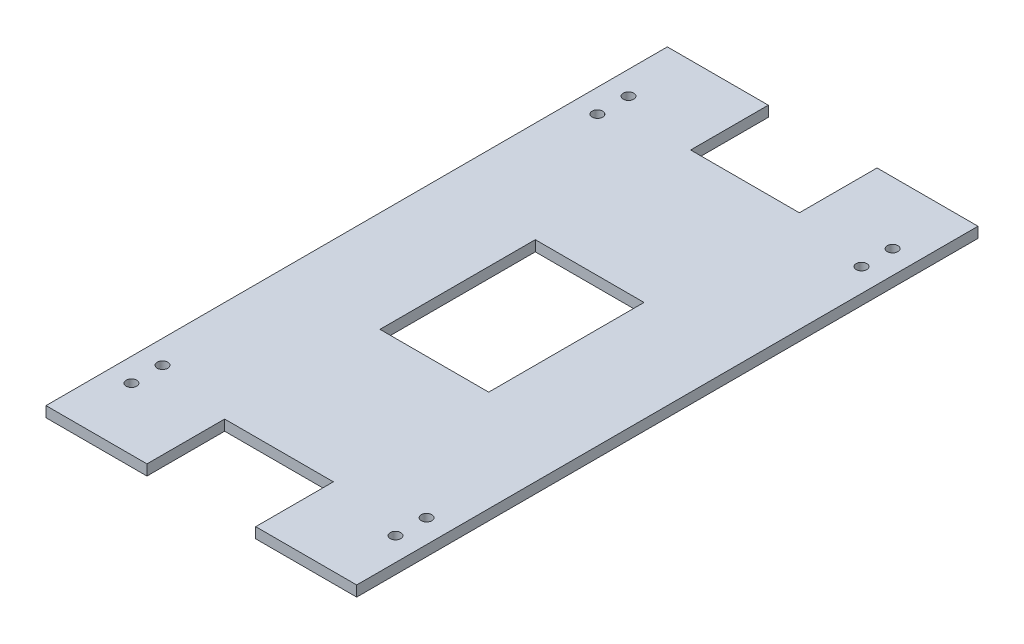
ISO-10303-21;
HEADER;
FILE_DESCRIPTION(('STEP AP214'),'2;1');
FILE_NAME('part.step','',(''),(''),'','','');
FILE_SCHEMA(('AUTOMOTIVE_DESIGN { 1 0 10303 214 1 1 1 1 }'));
ENDSEC;
DATA;
#1=APPLICATION_CONTEXT('core data for automotive mechanical design processes');
#2=APPLICATION_PROTOCOL_DEFINITION('international standard','automotive_design',2000,#1);
#3=PRODUCT_CONTEXT('',#1,'mechanical');
#4=PRODUCT('Part','Part','',(#3));
#5=PRODUCT_RELATED_PRODUCT_CATEGORY('part','',(#4));
#6=PRODUCT_DEFINITION_FORMATION('','',#4);
#7=PRODUCT_DEFINITION_CONTEXT('part definition',#1,'design');
#8=PRODUCT_DEFINITION('design','',#6,#7);
#9=PRODUCT_DEFINITION_SHAPE('','',#8);
#10=(LENGTH_UNIT() NAMED_UNIT(*) SI_UNIT(.MILLI.,.METRE.));
#11=(NAMED_UNIT(*) PLANE_ANGLE_UNIT() SI_UNIT($,.RADIAN.));
#12=(NAMED_UNIT(*) SI_UNIT($,.STERADIAN.) SOLID_ANGLE_UNIT());
#13=UNCERTAINTY_MEASURE_WITH_UNIT(LENGTH_MEASURE(1.E-05),#10,'distance_accuracy_value','');
#14=(GEOMETRIC_REPRESENTATION_CONTEXT(3) GLOBAL_UNCERTAINTY_ASSIGNED_CONTEXT((#13)) GLOBAL_UNIT_ASSIGNED_CONTEXT((#10,
#11,#12)) REPRESENTATION_CONTEXT('',''));
#15=CARTESIAN_POINT('',(0.,0.,0.));
#16=DIRECTION('',(0.,0.,1.));
#17=DIRECTION('',(1.,0.,0.));
#18=AXIS2_PLACEMENT_3D('',#15,#16,#17);
#19=CARTESIAN_POINT('',(-50.,3.4,-100.));
#20=DIRECTION('',(0.,0.,1.));
#21=DIRECTION('',(1.,0.,0.));
#22=AXIS2_PLACEMENT_3D('',#19,#20,#21);
#23=PLANE('',#22);
#24=DIRECTION('',(-1.,0.,0.));
#25=VECTOR('',#24,1.);
#26=CARTESIAN_POINT('',(-50.,3.4,-100.));
#27=LINE('',#26,#25);
#28=CARTESIAN_POINT('',(-17.5,3.4,-100.));
#29=VERTEX_POINT('',#28);
#30=CARTESIAN_POINT('',(-50.,3.4,-100.));
#31=VERTEX_POINT('',#30);
#32=EDGE_CURVE('E224',#29,#31,#27,.T.);
#33=ORIENTED_EDGE('',*,*,#32,.F.);
#34=DIRECTION('',(0.,1.,0.));
#35=VECTOR('',#34,1.);
#36=CARTESIAN_POINT('',(-17.5,-61.0327780786685,-100.));
#37=LINE('',#36,#35);
#38=CARTESIAN_POINT('',(-17.5,0.,-100.));
#39=VERTEX_POINT('',#38);
#40=EDGE_CURVE('E263',#39,#29,#37,.T.);
#41=ORIENTED_EDGE('',*,*,#40,.F.);
#42=DIRECTION('',(-1.,0.,0.));
#43=VECTOR('',#42,1.);
#44=CARTESIAN_POINT('',(-50.,0.,-100.));
#45=LINE('',#44,#43);
#46=CARTESIAN_POINT('',(-50.,0.,-100.));
#47=VERTEX_POINT('',#46);
#48=EDGE_CURVE('E186',#39,#47,#45,.T.);
#49=ORIENTED_EDGE('',*,*,#48,.T.);
#50=DIRECTION('',(0.,-1.,0.));
#51=VECTOR('',#50,1.);
#52=CARTESIAN_POINT('',(-50.,3.4,-100.));
#53=LINE('',#52,#51);
#54=EDGE_CURVE('E41',#31,#47,#53,.T.);
#55=ORIENTED_EDGE('',*,*,#54,.F.);
#56=EDGE_LOOP('',(#33,#41,#49,#55));
#57=FACE_BOUND('',#56,.T.);
#58=ADVANCED_FACE('F33',(#57),#23,.F.);
#59=CARTESIAN_POINT('',(-50.,3.4,100.));
#60=DIRECTION('',(0.,0.,-1.));
#61=DIRECTION('',(-1.,0.,0.));
#62=AXIS2_PLACEMENT_3D('',#59,#60,#61);
#63=PLANE('',#62);
#64=DIRECTION('',(1.,0.,0.));
#65=VECTOR('',#64,1.);
#66=CARTESIAN_POINT('',(-50.,0.,100.));
#67=LINE('',#66,#65);
#68=CARTESIAN_POINT('',(-50.,0.,100.));
#69=VERTEX_POINT('',#68);
#70=CARTESIAN_POINT('',(-17.5,0.,100.));
#71=VERTEX_POINT('',#70);
#72=EDGE_CURVE('E194',#69,#71,#67,.T.);
#73=ORIENTED_EDGE('',*,*,#72,.T.);
#74=DIRECTION('',(0.,1.,0.));
#75=VECTOR('',#74,1.);
#76=CARTESIAN_POINT('',(-17.5,-61.0327780786685,100.));
#77=LINE('',#76,#75);
#78=CARTESIAN_POINT('',(-17.5,3.4,100.));
#79=VERTEX_POINT('',#78);
#80=EDGE_CURVE('E223',#71,#79,#77,.T.);
#81=ORIENTED_EDGE('',*,*,#80,.T.);
#82=DIRECTION('',(1.,0.,0.));
#83=VECTOR('',#82,1.);
#84=CARTESIAN_POINT('',(-50.,3.4,100.));
#85=LINE('',#84,#83);
#86=CARTESIAN_POINT('',(-50.,3.4,100.));
#87=VERTEX_POINT('',#86);
#88=EDGE_CURVE('E175',#87,#79,#85,.T.);
#89=ORIENTED_EDGE('',*,*,#88,.F.);
#90=DIRECTION('',(0.,-1.,0.));
#91=VECTOR('',#90,1.);
#92=CARTESIAN_POINT('',(-50.,3.4,100.));
#93=LINE('',#92,#91);
#94=EDGE_CURVE('E199',#87,#69,#93,.T.);
#95=ORIENTED_EDGE('',*,*,#94,.T.);
#96=EDGE_LOOP('',(#73,#81,#89,#95));
#97=FACE_BOUND('',#96,.T.);
#98=ADVANCED_FACE('F221',(#97),#63,.F.);
#99=CARTESIAN_POINT('',(50.,3.4,-100.));
#100=DIRECTION('',(-1.,0.,0.));
#101=DIRECTION('',(0.,0.,1.));
#102=AXIS2_PLACEMENT_3D('',#99,#100,#101);
#103=PLANE('',#102);
#104=DIRECTION('',(0.,0.,-1.));
#105=VECTOR('',#104,1.);
#106=CARTESIAN_POINT('',(50.,0.,-100.));
#107=LINE('',#106,#105);
#108=CARTESIAN_POINT('',(50.,0.,100.));
#109=VERTEX_POINT('',#108);
#110=CARTESIAN_POINT('',(50.,0.,-100.));
#111=VERTEX_POINT('',#110);
#112=EDGE_CURVE('E183',#109,#111,#107,.T.);
#113=ORIENTED_EDGE('',*,*,#112,.T.);
#114=DIRECTION('',(0.,-1.,0.));
#115=VECTOR('',#114,1.);
#116=CARTESIAN_POINT('',(50.,3.4,-100.));
#117=LINE('',#116,#115);
#118=CARTESIAN_POINT('',(50.,3.4,-100.));
#119=VERTEX_POINT('',#118);
#120=EDGE_CURVE('E11',#119,#111,#117,.T.);
#121=ORIENTED_EDGE('',*,*,#120,.F.);
#122=DIRECTION('',(0.,0.,-1.));
#123=VECTOR('',#122,1.);
#124=CARTESIAN_POINT('',(50.,3.4,-100.));
#125=LINE('',#124,#123);
#126=CARTESIAN_POINT('',(50.,3.4,100.));
#127=VERTEX_POINT('',#126);
#128=EDGE_CURVE('E197',#127,#119,#125,.T.);
#129=ORIENTED_EDGE('',*,*,#128,.F.);
#130=DIRECTION('',(0.,-1.,0.));
#131=VECTOR('',#130,1.);
#132=CARTESIAN_POINT('',(50.,3.4,100.));
#133=LINE('',#132,#131);
#134=EDGE_CURVE('E173',#127,#109,#133,.T.);
#135=ORIENTED_EDGE('',*,*,#134,.T.);
#136=EDGE_LOOP('',(#113,#121,#129,#135));
#137=FACE_BOUND('',#136,.T.);
#138=ADVANCED_FACE('F35',(#137),#103,.F.);
#139=CARTESIAN_POINT('',(17.5,0.,-100.));
#140=VERTEX_POINT('',#139);
#141=EDGE_CURVE('E188',#111,#140,#45,.T.);
#142=ORIENTED_EDGE('',*,*,#141,.T.);
#143=DIRECTION('',(0.,1.,0.));
#144=VECTOR('',#143,1.);
#145=CARTESIAN_POINT('',(17.5,-61.0327780786685,-100.));
#146=LINE('',#145,#144);
#147=CARTESIAN_POINT('',(17.5,3.4,-100.));
#148=VERTEX_POINT('',#147);
#149=EDGE_CURVE('E260',#140,#148,#146,.T.);
#150=ORIENTED_EDGE('',*,*,#149,.T.);
#151=EDGE_CURVE('E179',#119,#148,#27,.T.);
#152=ORIENTED_EDGE('',*,*,#151,.F.);
#153=ORIENTED_EDGE('',*,*,#120,.T.);
#154=EDGE_LOOP('',(#142,#150,#152,#153));
#155=FACE_BOUND('',#154,.T.);
#156=ADVANCED_FACE('F361',(#155),#23,.F.);
#157=CARTESIAN_POINT('',(-50.,3.4,-100.));
#158=DIRECTION('',(1.,0.,0.));
#159=DIRECTION('',(0.,0.,-1.));
#160=AXIS2_PLACEMENT_3D('',#157,#158,#159);
#161=PLANE('',#160);
#162=DIRECTION('',(0.,0.,1.));
#163=VECTOR('',#162,1.);
#164=CARTESIAN_POINT('',(-50.,0.,-100.));
#165=LINE('',#164,#163);
#166=EDGE_CURVE('E191',#47,#69,#165,.T.);
#167=ORIENTED_EDGE('',*,*,#166,.T.);
#168=ORIENTED_EDGE('',*,*,#94,.F.);
#169=DIRECTION('',(0.,0.,1.));
#170=VECTOR('',#169,1.);
#171=CARTESIAN_POINT('',(-50.,3.4,-100.));
#172=LINE('',#171,#170);
#173=EDGE_CURVE('E176',#31,#87,#172,.T.);
#174=ORIENTED_EDGE('',*,*,#173,.F.);
#175=ORIENTED_EDGE('',*,*,#54,.T.);
#176=EDGE_LOOP('',(#167,#168,#174,#175));
#177=FACE_BOUND('',#176,.T.);
#178=ADVANCED_FACE('F206',(#177),#161,.F.);
#179=CARTESIAN_POINT('',(17.5,3.4,100.));
#180=VERTEX_POINT('',#179);
#181=EDGE_CURVE('E165',#180,#127,#85,.T.);
#182=ORIENTED_EDGE('',*,*,#181,.F.);
#183=DIRECTION('',(0.,1.,0.));
#184=VECTOR('',#183,1.);
#185=CARTESIAN_POINT('',(17.5,-61.0327780786685,100.));
#186=LINE('',#185,#184);
#187=CARTESIAN_POINT('',(17.5,0.,100.));
#188=VERTEX_POINT('',#187);
#189=EDGE_CURVE('E147',#188,#180,#186,.T.);
#190=ORIENTED_EDGE('',*,*,#189,.F.);
#191=EDGE_CURVE('E193',#188,#109,#67,.T.);
#192=ORIENTED_EDGE('',*,*,#191,.T.);
#193=ORIENTED_EDGE('',*,*,#134,.F.);
#194=EDGE_LOOP('',(#182,#190,#192,#193));
#195=FACE_BOUND('',#194,.T.);
#196=ADVANCED_FACE('F171',(#195),#63,.F.);
#197=CARTESIAN_POINT('',(0.,3.4,0.));
#198=DIRECTION('',(0.,1.,0.));
#199=DIRECTION('',(0.,0.,1.));
#200=AXIS2_PLACEMENT_3D('',#197,#198,#199);
#201=PLANE('',#200);
#202=DIRECTION('',(0.,0.,1.));
#203=VECTOR('',#202,1.);
#204=CARTESIAN_POINT('',(-17.5,3.4,-25.));
#205=LINE('',#204,#203);
#206=CARTESIAN_POINT('',(-17.5,3.4,-25.));
#207=VERTEX_POINT('',#206);
#208=CARTESIAN_POINT('',(-17.5,3.4,25.));
#209=VERTEX_POINT('',#208);
#210=EDGE_CURVE('E48',#207,#209,#205,.T.);
#211=ORIENTED_EDGE('',*,*,#210,.F.);
#212=DIRECTION('',(-1.,0.,0.));
#213=VECTOR('',#212,1.);
#214=CARTESIAN_POINT('',(-17.5,3.4,-25.));
#215=LINE('',#214,#213);
#216=CARTESIAN_POINT('',(17.5,3.4,-25.));
#217=VERTEX_POINT('',#216);
#218=EDGE_CURVE('E289',#217,#207,#215,.T.);
#219=ORIENTED_EDGE('',*,*,#218,.F.);
#220=DIRECTION('',(0.,0.,-1.));
#221=VECTOR('',#220,1.);
#222=CARTESIAN_POINT('',(17.5,3.4,-25.));
#223=LINE('',#222,#221);
#224=CARTESIAN_POINT('',(17.5,3.4,25.));
#225=VERTEX_POINT('',#224);
#226=EDGE_CURVE('E298',#225,#217,#223,.T.);
#227=ORIENTED_EDGE('',*,*,#226,.F.);
#228=DIRECTION('',(1.,0.,0.));
#229=VECTOR('',#228,1.);
#230=CARTESIAN_POINT('',(-17.5,3.4,25.));
#231=LINE('',#230,#229);
#232=EDGE_CURVE('E301',#209,#225,#231,.T.);
#233=ORIENTED_EDGE('',*,*,#232,.F.);
#234=EDGE_LOOP('',(#211,#219,#227,#233));
#235=FACE_BOUND('',#234,.T.);
#236=CARTESIAN_POINT('',(42.5,3.4,-70.));
#237=DIRECTION('',(0.,1.,0.));
#238=DIRECTION('',(0.,0.,-1.));
#239=AXIS2_PLACEMENT_3D('',#236,#237,#238);
#240=CIRCLE('',#239,1.7);
#241=CARTESIAN_POINT('',(42.5,3.4,-71.7));
#242=VERTEX_POINT('',#241);
#243=EDGE_CURVE('E281',#242,#242,#240,.T.);
#244=ORIENTED_EDGE('',*,*,#243,.F.);
#245=EDGE_LOOP('',(#244));
#246=FACE_BOUND('',#245,.T.);
#247=CARTESIAN_POINT('',(42.5,3.4,-80.));
#248=DIRECTION('',(0.,1.,0.));
#249=DIRECTION('',(0.,0.,-1.));
#250=AXIS2_PLACEMENT_3D('',#247,#248,#249);
#251=CIRCLE('',#250,1.7);
#252=CARTESIAN_POINT('',(42.5,3.4,-81.7));
#253=VERTEX_POINT('',#252);
#254=EDGE_CURVE('E311',#253,#253,#251,.T.);
#255=ORIENTED_EDGE('',*,*,#254,.F.);
#256=EDGE_LOOP('',(#255));
#257=FACE_BOUND('',#256,.T.);
#258=CARTESIAN_POINT('',(-42.5,3.4,-70.));
#259=DIRECTION('',(0.,1.,0.));
#260=DIRECTION('',(0.,0.,1.));
#261=AXIS2_PLACEMENT_3D('',#258,#259,#260);
#262=CIRCLE('',#261,1.7);
#263=CARTESIAN_POINT('',(-42.5,3.4,-68.3));
#264=VERTEX_POINT('',#263);
#265=EDGE_CURVE('E312',#264,#264,#262,.T.);
#266=ORIENTED_EDGE('',*,*,#265,.F.);
#267=EDGE_LOOP('',(#266));
#268=FACE_BOUND('',#267,.T.);
#269=CARTESIAN_POINT('',(-42.5,3.4,70.));
#270=DIRECTION('',(0.,1.,0.));
#271=DIRECTION('',(0.,0.,-1.));
#272=AXIS2_PLACEMENT_3D('',#269,#270,#271);
#273=CIRCLE('',#272,1.7);
#274=CARTESIAN_POINT('',(-42.5,3.4,68.3));
#275=VERTEX_POINT('',#274);
#276=EDGE_CURVE('E242',#275,#275,#273,.T.);
#277=ORIENTED_EDGE('',*,*,#276,.F.);
#278=EDGE_LOOP('',(#277));
#279=FACE_BOUND('',#278,.T.);
#280=CARTESIAN_POINT('',(-42.5,3.4,80.));
#281=DIRECTION('',(0.,1.,0.));
#282=DIRECTION('',(0.,0.,-1.));
#283=AXIS2_PLACEMENT_3D('',#280,#281,#282);
#284=CIRCLE('',#283,1.7);
#285=CARTESIAN_POINT('',(-42.5,3.4,78.3));
#286=VERTEX_POINT('',#285);
#287=EDGE_CURVE('E241',#286,#286,#284,.T.);
#288=ORIENTED_EDGE('',*,*,#287,.F.);
#289=EDGE_LOOP('',(#288));
#290=FACE_BOUND('',#289,.T.);
#291=DIRECTION('',(0.,0.,1.));
#292=VECTOR('',#291,1.);
#293=CARTESIAN_POINT('',(-17.5,3.4,-100.));
#294=LINE('',#293,#292);
#295=CARTESIAN_POINT('',(-17.5,3.4,-75.));
#296=VERTEX_POINT('',#295);
#297=EDGE_CURVE('E227',#29,#296,#294,.T.);
#298=ORIENTED_EDGE('',*,*,#297,.F.);
#299=ORIENTED_EDGE('',*,*,#32,.T.);
#300=ORIENTED_EDGE('',*,*,#173,.T.);
#301=ORIENTED_EDGE('',*,*,#88,.T.);
#302=DIRECTION('',(0.,0.,1.));
#303=VECTOR('',#302,1.);
#304=CARTESIAN_POINT('',(-17.5,3.4,100.));
#305=LINE('',#304,#303);
#306=CARTESIAN_POINT('',(-17.5,3.4,75.));
#307=VERTEX_POINT('',#306);
#308=EDGE_CURVE('E158',#307,#79,#305,.T.);
#309=ORIENTED_EDGE('',*,*,#308,.F.);
#310=DIRECTION('',(-1.,0.,0.));
#311=VECTOR('',#310,1.);
#312=CARTESIAN_POINT('',(-17.5,3.4,75.));
#313=LINE('',#312,#311);
#314=CARTESIAN_POINT('',(17.5,3.4,75.));
#315=VERTEX_POINT('',#314);
#316=EDGE_CURVE('E169',#315,#307,#313,.T.);
#317=ORIENTED_EDGE('',*,*,#316,.F.);
#318=DIRECTION('',(0.,0.,-1.));
#319=VECTOR('',#318,1.);
#320=CARTESIAN_POINT('',(17.5,3.4,100.));
#321=LINE('',#320,#319);
#322=EDGE_CURVE('E150',#180,#315,#321,.T.);
#323=ORIENTED_EDGE('',*,*,#322,.F.);
#324=ORIENTED_EDGE('',*,*,#181,.T.);
#325=ORIENTED_EDGE('',*,*,#128,.T.);
#326=ORIENTED_EDGE('',*,*,#151,.T.);
#327=DIRECTION('',(0.,0.,-1.));
#328=VECTOR('',#327,1.);
#329=CARTESIAN_POINT('',(17.5,3.4,-100.));
#330=LINE('',#329,#328);
#331=CARTESIAN_POINT('',(17.5,3.4,-75.));
#332=VERTEX_POINT('',#331);
#333=EDGE_CURVE('E258',#332,#148,#330,.T.);
#334=ORIENTED_EDGE('',*,*,#333,.F.);
#335=DIRECTION('',(1.,0.,0.));
#336=VECTOR('',#335,1.);
#337=CARTESIAN_POINT('',(-17.5,3.4,-75.));
#338=LINE('',#337,#336);
#339=EDGE_CURVE('E267',#296,#332,#338,.T.);
#340=ORIENTED_EDGE('',*,*,#339,.F.);
#341=EDGE_LOOP('',(#298,#299,#300,#301,#309,#317,#323,#324,#325,#326,#334,#340));
#342=FACE_BOUND('',#341,.T.);
#343=CARTESIAN_POINT('',(42.5,3.4,70.));
#344=DIRECTION('',(0.,1.,0.));
#345=DIRECTION('',(0.,0.,1.));
#346=AXIS2_PLACEMENT_3D('',#343,#344,#345);
#347=CIRCLE('',#346,1.7);
#348=CARTESIAN_POINT('',(42.5,3.4,71.7));
#349=VERTEX_POINT('',#348);
#350=EDGE_CURVE('E253',#349,#349,#347,.T.);
#351=ORIENTED_EDGE('',*,*,#350,.F.);
#352=EDGE_LOOP('',(#351));
#353=FACE_BOUND('',#352,.T.);
#354=CARTESIAN_POINT('',(-42.5,3.4,-80.));
#355=DIRECTION('',(0.,1.,0.));
#356=DIRECTION('',(0.,0.,1.));
#357=AXIS2_PLACEMENT_3D('',#354,#355,#356);
#358=CIRCLE('',#357,1.7);
#359=CARTESIAN_POINT('',(-42.5,3.4,-78.3));
#360=VERTEX_POINT('',#359);
#361=EDGE_CURVE('E320',#360,#360,#358,.T.);
#362=ORIENTED_EDGE('',*,*,#361,.F.);
#363=EDGE_LOOP('',(#362));
#364=FACE_BOUND('',#363,.T.);
#365=CARTESIAN_POINT('',(42.5,3.4,80.));
#366=DIRECTION('',(0.,1.,0.));
#367=DIRECTION('',(0.,0.,1.));
#368=AXIS2_PLACEMENT_3D('',#365,#366,#367);
#369=CIRCLE('',#368,1.7);
#370=CARTESIAN_POINT('',(42.5,3.4,81.7));
#371=VERTEX_POINT('',#370);
#372=EDGE_CURVE('E234',#371,#371,#369,.T.);
#373=ORIENTED_EDGE('',*,*,#372,.F.);
#374=EDGE_LOOP('',(#373));
#375=FACE_BOUND('',#374,.T.);
#376=ADVANCED_FACE('F162',(#235,#246,#257,#268,#279,#290,#342,#353,#364,#375),#201,.T.);
#377=CARTESIAN_POINT('',(0.,0.,0.));
#378=DIRECTION('',(0.,1.,0.));
#379=DIRECTION('',(0.,0.,1.));
#380=AXIS2_PLACEMENT_3D('',#377,#378,#379);
#381=PLANE('',#380);
#382=DIRECTION('',(1.,0.,0.));
#383=VECTOR('',#382,1.);
#384=CARTESIAN_POINT('',(-17.5,0.,-25.));
#385=LINE('',#384,#383);
#386=CARTESIAN_POINT('',(-17.5,0.,-25.));
#387=VERTEX_POINT('',#386);
#388=CARTESIAN_POINT('',(17.5,0.,-25.));
#389=VERTEX_POINT('',#388);
#390=EDGE_CURVE('E305',#387,#389,#385,.T.);
#391=ORIENTED_EDGE('',*,*,#390,.F.);
#392=DIRECTION('',(0.,0.,-1.));
#393=VECTOR('',#392,1.);
#394=CARTESIAN_POINT('',(-17.5,0.,-25.));
#395=LINE('',#394,#393);
#396=CARTESIAN_POINT('',(-17.5,0.,25.));
#397=VERTEX_POINT('',#396);
#398=EDGE_CURVE('E286',#397,#387,#395,.T.);
#399=ORIENTED_EDGE('',*,*,#398,.F.);
#400=DIRECTION('',(-1.,0.,0.));
#401=VECTOR('',#400,1.);
#402=CARTESIAN_POINT('',(-17.5,0.,25.));
#403=LINE('',#402,#401);
#404=CARTESIAN_POINT('',(17.5,0.,25.));
#405=VERTEX_POINT('',#404);
#406=EDGE_CURVE('E245',#405,#397,#403,.T.);
#407=ORIENTED_EDGE('',*,*,#406,.F.);
#408=DIRECTION('',(0.,0.,1.));
#409=VECTOR('',#408,1.);
#410=CARTESIAN_POINT('',(17.5,0.,-25.));
#411=LINE('',#410,#409);
#412=EDGE_CURVE('E295',#389,#405,#411,.T.);
#413=ORIENTED_EDGE('',*,*,#412,.F.);
#414=EDGE_LOOP('',(#391,#399,#407,#413));
#415=FACE_BOUND('',#414,.T.);
#416=CARTESIAN_POINT('',(42.5,0.,-70.));
#417=DIRECTION('',(0.,1.,0.));
#418=DIRECTION('',(0.,0.,1.));
#419=AXIS2_PLACEMENT_3D('',#416,#417,#418);
#420=CIRCLE('',#419,1.7);
#421=CARTESIAN_POINT('',(42.5,0.,-68.3));
#422=VERTEX_POINT('',#421);
#423=EDGE_CURVE('E278',#422,#422,#420,.F.);
#424=ORIENTED_EDGE('',*,*,#423,.F.);
#425=EDGE_LOOP('',(#424));
#426=FACE_BOUND('',#425,.T.);
#427=CARTESIAN_POINT('',(42.5,0.,-80.));
#428=DIRECTION('',(0.,1.,0.));
#429=DIRECTION('',(0.,0.,1.));
#430=AXIS2_PLACEMENT_3D('',#427,#428,#429);
#431=CIRCLE('',#430,1.7);
#432=CARTESIAN_POINT('',(42.5,0.,-78.3));
#433=VERTEX_POINT('',#432);
#434=EDGE_CURVE('E284',#433,#433,#431,.F.);
#435=ORIENTED_EDGE('',*,*,#434,.F.);
#436=EDGE_LOOP('',(#435));
#437=FACE_BOUND('',#436,.T.);
#438=CARTESIAN_POINT('',(-42.5,0.,-70.));
#439=DIRECTION('',(0.,1.,0.));
#440=DIRECTION('',(0.,0.,1.));
#441=AXIS2_PLACEMENT_3D('',#438,#439,#440);
#442=CIRCLE('',#441,1.7);
#443=CARTESIAN_POINT('',(-42.5,0.,-68.3));
#444=VERTEX_POINT('',#443);
#445=EDGE_CURVE('E308',#444,#444,#442,.F.);
#446=ORIENTED_EDGE('',*,*,#445,.F.);
#447=EDGE_LOOP('',(#446));
#448=FACE_BOUND('',#447,.T.);
#449=CARTESIAN_POINT('',(-42.5,0.,70.));
#450=DIRECTION('',(0.,1.,0.));
#451=DIRECTION('',(0.,0.,1.));
#452=AXIS2_PLACEMENT_3D('',#449,#450,#451);
#453=CIRCLE('',#452,1.7);
#454=CARTESIAN_POINT('',(-42.5,0.,71.7));
#455=VERTEX_POINT('',#454);
#456=EDGE_CURVE('E238',#455,#455,#453,.F.);
#457=ORIENTED_EDGE('',*,*,#456,.F.);
#458=EDGE_LOOP('',(#457));
#459=FACE_BOUND('',#458,.T.);
#460=CARTESIAN_POINT('',(-42.5,0.,80.));
#461=DIRECTION('',(0.,1.,0.));
#462=DIRECTION('',(0.,0.,1.));
#463=AXIS2_PLACEMENT_3D('',#460,#461,#462);
#464=CIRCLE('',#463,1.7);
#465=CARTESIAN_POINT('',(-42.5,0.,81.7));
#466=VERTEX_POINT('',#465);
#467=EDGE_CURVE('E246',#466,#466,#464,.F.);
#468=ORIENTED_EDGE('',*,*,#467,.F.);
#469=EDGE_LOOP('',(#468));
#470=FACE_BOUND('',#469,.T.);
#471=ORIENTED_EDGE('',*,*,#48,.F.);
#472=DIRECTION('',(0.,0.,-1.));
#473=VECTOR('',#472,1.);
#474=CARTESIAN_POINT('',(-17.5,0.,-100.));
#475=LINE('',#474,#473);
#476=CARTESIAN_POINT('',(-17.5,0.,-75.));
#477=VERTEX_POINT('',#476);
#478=EDGE_CURVE('E254',#477,#39,#475,.T.);
#479=ORIENTED_EDGE('',*,*,#478,.F.);
#480=DIRECTION('',(-1.,0.,0.));
#481=VECTOR('',#480,1.);
#482=CARTESIAN_POINT('',(-17.5,0.,-75.));
#483=LINE('',#482,#481);
#484=CARTESIAN_POINT('',(17.5,0.,-75.));
#485=VERTEX_POINT('',#484);
#486=EDGE_CURVE('E251',#485,#477,#483,.T.);
#487=ORIENTED_EDGE('',*,*,#486,.F.);
#488=DIRECTION('',(0.,0.,1.));
#489=VECTOR('',#488,1.);
#490=CARTESIAN_POINT('',(17.5,0.,-100.));
#491=LINE('',#490,#489);
#492=EDGE_CURVE('E265',#140,#485,#491,.T.);
#493=ORIENTED_EDGE('',*,*,#492,.F.);
#494=ORIENTED_EDGE('',*,*,#141,.F.);
#495=ORIENTED_EDGE('',*,*,#112,.F.);
#496=ORIENTED_EDGE('',*,*,#191,.F.);
#497=DIRECTION('',(0.,0.,1.));
#498=VECTOR('',#497,1.);
#499=CARTESIAN_POINT('',(17.5,0.,100.));
#500=LINE('',#499,#498);
#501=CARTESIAN_POINT('',(17.5,0.,75.));
#502=VERTEX_POINT('',#501);
#503=EDGE_CURVE('E153',#502,#188,#500,.T.);
#504=ORIENTED_EDGE('',*,*,#503,.F.);
#505=DIRECTION('',(1.,0.,0.));
#506=VECTOR('',#505,1.);
#507=CARTESIAN_POINT('',(-17.5,0.,75.));
#508=LINE('',#507,#506);
#509=CARTESIAN_POINT('',(-17.5,0.,75.));
#510=VERTEX_POINT('',#509);
#511=EDGE_CURVE('E326',#510,#502,#508,.T.);
#512=ORIENTED_EDGE('',*,*,#511,.F.);
#513=DIRECTION('',(0.,0.,-1.));
#514=VECTOR('',#513,1.);
#515=CARTESIAN_POINT('',(-17.5,0.,100.));
#516=LINE('',#515,#514);
#517=EDGE_CURVE('E218',#71,#510,#516,.T.);
#518=ORIENTED_EDGE('',*,*,#517,.F.);
#519=ORIENTED_EDGE('',*,*,#72,.F.);
#520=ORIENTED_EDGE('',*,*,#166,.F.);
#521=EDGE_LOOP('',(#471,#479,#487,#493,#494,#495,#496,#504,#512,#518,#519,#520));
#522=FACE_BOUND('',#521,.T.);
#523=CARTESIAN_POINT('',(42.5,0.,70.));
#524=DIRECTION('',(0.,1.,0.));
#525=DIRECTION('',(0.,0.,1.));
#526=AXIS2_PLACEMENT_3D('',#523,#524,#525);
#527=CIRCLE('',#526,1.7);
#528=CARTESIAN_POINT('',(42.5,0.,71.7));
#529=VERTEX_POINT('',#528);
#530=EDGE_CURVE('E237',#529,#529,#527,.F.);
#531=ORIENTED_EDGE('',*,*,#530,.F.);
#532=EDGE_LOOP('',(#531));
#533=FACE_BOUND('',#532,.T.);
#534=CARTESIAN_POINT('',(-42.5,0.,-80.));
#535=DIRECTION('',(0.,1.,0.));
#536=DIRECTION('',(0.,0.,1.));
#537=AXIS2_PLACEMENT_3D('',#534,#535,#536);
#538=CIRCLE('',#537,1.7);
#539=CARTESIAN_POINT('',(-42.5,0.,-78.3));
#540=VERTEX_POINT('',#539);
#541=EDGE_CURVE('E315',#540,#540,#538,.F.);
#542=ORIENTED_EDGE('',*,*,#541,.F.);
#543=EDGE_LOOP('',(#542));
#544=FACE_BOUND('',#543,.T.);
#545=CARTESIAN_POINT('',(42.5,0.,80.));
#546=DIRECTION('',(0.,1.,0.));
#547=DIRECTION('',(0.,0.,1.));
#548=AXIS2_PLACEMENT_3D('',#545,#546,#547);
#549=CIRCLE('',#548,1.7);
#550=CARTESIAN_POINT('',(42.5,0.,81.7));
#551=VERTEX_POINT('',#550);
#552=EDGE_CURVE('E187',#551,#551,#549,.F.);
#553=ORIENTED_EDGE('',*,*,#552,.F.);
#554=EDGE_LOOP('',(#553));
#555=FACE_BOUND('',#554,.T.);
#556=ADVANCED_FACE('F213',(#415,#426,#437,#448,#459,#470,#522,#533,#544,#555),#381,.F.);
#557=CARTESIAN_POINT('',(42.5,-61.0327780786685,80.));
#558=DIRECTION('',(0.,1.,0.));
#559=DIRECTION('',(0.,0.,1.));
#560=AXIS2_PLACEMENT_3D('',#557,#558,#559);
#561=CYLINDRICAL_SURFACE('',#560,1.7);
#562=ORIENTED_EDGE('',*,*,#552,.T.);
#563=EDGE_LOOP('',(#562));
#564=FACE_BOUND('',#563,.T.);
#565=ORIENTED_EDGE('',*,*,#372,.T.);
#566=EDGE_LOOP('',(#565));
#567=FACE_BOUND('',#566,.T.);
#568=ADVANCED_FACE('F345',(#564,#567),#561,.F.);
#569=CARTESIAN_POINT('',(-17.5,-61.0327780786685,100.));
#570=DIRECTION('',(-1.,0.,0.));
#571=DIRECTION('',(0.,0.,1.));
#572=AXIS2_PLACEMENT_3D('',#569,#570,#571);
#573=PLANE('',#572);
#574=ORIENTED_EDGE('',*,*,#517,.T.);
#575=DIRECTION('',(0.,1.,0.));
#576=VECTOR('',#575,1.);
#577=CARTESIAN_POINT('',(-17.5,-61.0327780786685,75.));
#578=LINE('',#577,#576);
#579=EDGE_CURVE('E323',#510,#307,#578,.T.);
#580=ORIENTED_EDGE('',*,*,#579,.T.);
#581=ORIENTED_EDGE('',*,*,#308,.T.);
#582=ORIENTED_EDGE('',*,*,#80,.F.);
#583=EDGE_LOOP('',(#574,#580,#581,#582));
#584=FACE_BOUND('',#583,.T.);
#585=ADVANCED_FACE('F347',(#584),#573,.F.);
#586=CARTESIAN_POINT('',(-17.5,-61.0327780786685,75.));
#587=DIRECTION('',(0.,0.,-1.));
#588=DIRECTION('',(-1.,0.,0.));
#589=AXIS2_PLACEMENT_3D('',#586,#587,#588);
#590=PLANE('',#589);
#591=ORIENTED_EDGE('',*,*,#511,.T.);
#592=DIRECTION('',(0.,1.,0.));
#593=VECTOR('',#592,1.);
#594=CARTESIAN_POINT('',(17.5,-61.0327780786685,75.));
#595=LINE('',#594,#593);
#596=EDGE_CURVE('E157',#502,#315,#595,.T.);
#597=ORIENTED_EDGE('',*,*,#596,.T.);
#598=ORIENTED_EDGE('',*,*,#316,.T.);
#599=ORIENTED_EDGE('',*,*,#579,.F.);
#600=EDGE_LOOP('',(#591,#597,#598,#599));
#601=FACE_BOUND('',#600,.T.);
#602=ADVANCED_FACE('F354',(#601),#590,.F.);
#603=CARTESIAN_POINT('',(17.5,-61.0327780786685,100.));
#604=DIRECTION('',(1.,0.,0.));
#605=DIRECTION('',(0.,0.,-1.));
#606=AXIS2_PLACEMENT_3D('',#603,#604,#605);
#607=PLANE('',#606);
#608=ORIENTED_EDGE('',*,*,#503,.T.);
#609=ORIENTED_EDGE('',*,*,#189,.T.);
#610=ORIENTED_EDGE('',*,*,#322,.T.);
#611=ORIENTED_EDGE('',*,*,#596,.F.);
#612=EDGE_LOOP('',(#608,#609,#610,#611));
#613=FACE_BOUND('',#612,.T.);
#614=ADVANCED_FACE('F149',(#613),#607,.F.);
#615=CARTESIAN_POINT('',(-42.5,-61.0327780786685,-80.));
#616=DIRECTION('',(0.,1.,0.));
#617=DIRECTION('',(0.,0.,1.));
#618=AXIS2_PLACEMENT_3D('',#615,#616,#617);
#619=CYLINDRICAL_SURFACE('',#618,1.7);
#620=ORIENTED_EDGE('',*,*,#541,.T.);
#621=EDGE_LOOP('',(#620));
#622=FACE_BOUND('',#621,.T.);
#623=ORIENTED_EDGE('',*,*,#361,.T.);
#624=EDGE_LOOP('',(#623));
#625=FACE_BOUND('',#624,.T.);
#626=ADVANCED_FACE('F337',(#622,#625),#619,.F.);
#627=CARTESIAN_POINT('',(42.5,-61.0327780786685,70.));
#628=DIRECTION('',(0.,1.,0.));
#629=DIRECTION('',(0.,0.,1.));
#630=AXIS2_PLACEMENT_3D('',#627,#628,#629);
#631=CYLINDRICAL_SURFACE('',#630,1.7);
#632=ORIENTED_EDGE('',*,*,#530,.T.);
#633=EDGE_LOOP('',(#632));
#634=FACE_BOUND('',#633,.T.);
#635=ORIENTED_EDGE('',*,*,#350,.T.);
#636=EDGE_LOOP('',(#635));
#637=FACE_BOUND('',#636,.T.);
#638=ADVANCED_FACE('F387',(#634,#637),#631,.F.);
#639=CARTESIAN_POINT('',(-17.5,-61.0327780786685,-100.));
#640=DIRECTION('',(-1.,0.,0.));
#641=DIRECTION('',(0.,0.,1.));
#642=AXIS2_PLACEMENT_3D('',#639,#640,#641);
#643=PLANE('',#642);
#644=ORIENTED_EDGE('',*,*,#478,.T.);
#645=ORIENTED_EDGE('',*,*,#40,.T.);
#646=ORIENTED_EDGE('',*,*,#297,.T.);
#647=DIRECTION('',(0.,1.,0.));
#648=VECTOR('',#647,1.);
#649=CARTESIAN_POINT('',(-17.5,-61.0327780786685,-75.));
#650=LINE('',#649,#648);
#651=EDGE_CURVE('E255',#477,#296,#650,.T.);
#652=ORIENTED_EDGE('',*,*,#651,.F.);
#653=EDGE_LOOP('',(#644,#645,#646,#652));
#654=FACE_BOUND('',#653,.T.);
#655=ADVANCED_FACE('F385',(#654),#643,.F.);
#656=CARTESIAN_POINT('',(17.5,-61.0327780786685,-100.));
#657=DIRECTION('',(1.,0.,0.));
#658=DIRECTION('',(0.,0.,-1.));
#659=AXIS2_PLACEMENT_3D('',#656,#657,#658);
#660=PLANE('',#659);
#661=ORIENTED_EDGE('',*,*,#492,.T.);
#662=DIRECTION('',(0.,1.,0.));
#663=VECTOR('',#662,1.);
#664=CARTESIAN_POINT('',(17.5,-61.0327780786685,-75.));
#665=LINE('',#664,#663);
#666=EDGE_CURVE('E257',#485,#332,#665,.T.);
#667=ORIENTED_EDGE('',*,*,#666,.T.);
#668=ORIENTED_EDGE('',*,*,#333,.T.);
#669=ORIENTED_EDGE('',*,*,#149,.F.);
#670=EDGE_LOOP('',(#661,#667,#668,#669));
#671=FACE_BOUND('',#670,.T.);
#672=ADVANCED_FACE('F379',(#671),#660,.F.);
#673=CARTESIAN_POINT('',(-17.5,-61.0327780786685,-75.));
#674=DIRECTION('',(0.,0.,1.));
#675=DIRECTION('',(1.,0.,0.));
#676=AXIS2_PLACEMENT_3D('',#673,#674,#675);
#677=PLANE('',#676);
#678=ORIENTED_EDGE('',*,*,#486,.T.);
#679=ORIENTED_EDGE('',*,*,#651,.T.);
#680=ORIENTED_EDGE('',*,*,#339,.T.);
#681=ORIENTED_EDGE('',*,*,#666,.F.);
#682=EDGE_LOOP('',(#678,#679,#680,#681));
#683=FACE_BOUND('',#682,.T.);
#684=ADVANCED_FACE('F382',(#683),#677,.F.);
#685=CARTESIAN_POINT('',(-42.5,-61.0327780786685,80.));
#686=DIRECTION('',(0.,1.,0.));
#687=DIRECTION('',(0.,0.,1.));
#688=AXIS2_PLACEMENT_3D('',#685,#686,#687);
#689=CYLINDRICAL_SURFACE('',#688,1.7);
#690=ORIENTED_EDGE('',*,*,#467,.T.);
#691=EDGE_LOOP('',(#690));
#692=FACE_BOUND('',#691,.T.);
#693=ORIENTED_EDGE('',*,*,#287,.T.);
#694=EDGE_LOOP('',(#693));
#695=FACE_BOUND('',#694,.T.);
#696=ADVANCED_FACE('F398',(#692,#695),#689,.F.);
#697=CARTESIAN_POINT('',(-42.5,-61.0327780786685,70.));
#698=DIRECTION('',(0.,1.,0.));
#699=DIRECTION('',(0.,0.,1.));
#700=AXIS2_PLACEMENT_3D('',#697,#698,#699);
#701=CYLINDRICAL_SURFACE('',#700,1.7);
#702=ORIENTED_EDGE('',*,*,#456,.T.);
#703=EDGE_LOOP('',(#702));
#704=FACE_BOUND('',#703,.T.);
#705=ORIENTED_EDGE('',*,*,#276,.T.);
#706=EDGE_LOOP('',(#705));
#707=FACE_BOUND('',#706,.T.);
#708=ADVANCED_FACE('F400',(#704,#707),#701,.F.);
#709=CARTESIAN_POINT('',(-42.5,-61.0327780786685,-70.));
#710=DIRECTION('',(0.,1.,0.));
#711=DIRECTION('',(0.,0.,1.));
#712=AXIS2_PLACEMENT_3D('',#709,#710,#711);
#713=CYLINDRICAL_SURFACE('',#712,1.7);
#714=ORIENTED_EDGE('',*,*,#445,.T.);
#715=EDGE_LOOP('',(#714));
#716=FACE_BOUND('',#715,.T.);
#717=ORIENTED_EDGE('',*,*,#265,.T.);
#718=EDGE_LOOP('',(#717));
#719=FACE_BOUND('',#718,.T.);
#720=ADVANCED_FACE('F403',(#716,#719),#713,.F.);
#721=CARTESIAN_POINT('',(42.5,-61.0327780786685,-80.));
#722=DIRECTION('',(0.,1.,0.));
#723=DIRECTION('',(0.,0.,1.));
#724=AXIS2_PLACEMENT_3D('',#721,#722,#723);
#725=CYLINDRICAL_SURFACE('',#724,1.7);
#726=ORIENTED_EDGE('',*,*,#434,.T.);
#727=EDGE_LOOP('',(#726));
#728=FACE_BOUND('',#727,.T.);
#729=ORIENTED_EDGE('',*,*,#254,.T.);
#730=EDGE_LOOP('',(#729));
#731=FACE_BOUND('',#730,.T.);
#732=ADVANCED_FACE('F408',(#728,#731),#725,.F.);
#733=CARTESIAN_POINT('',(42.5,-61.0327780786685,-70.));
#734=DIRECTION('',(0.,1.,0.));
#735=DIRECTION('',(0.,0.,1.));
#736=AXIS2_PLACEMENT_3D('',#733,#734,#735);
#737=CYLINDRICAL_SURFACE('',#736,1.7);
#738=ORIENTED_EDGE('',*,*,#423,.T.);
#739=EDGE_LOOP('',(#738));
#740=FACE_BOUND('',#739,.T.);
#741=ORIENTED_EDGE('',*,*,#243,.T.);
#742=EDGE_LOOP('',(#741));
#743=FACE_BOUND('',#742,.T.);
#744=ADVANCED_FACE('F424',(#740,#743),#737,.F.);
#745=CARTESIAN_POINT('',(-17.5,-61.0327780786685,-25.));
#746=DIRECTION('',(-1.,0.,0.));
#747=DIRECTION('',(0.,0.,1.));
#748=AXIS2_PLACEMENT_3D('',#745,#746,#747);
#749=PLANE('',#748);
#750=ORIENTED_EDGE('',*,*,#398,.T.);
#751=DIRECTION('',(0.,1.,0.));
#752=VECTOR('',#751,1.);
#753=CARTESIAN_POINT('',(-17.5,-61.0327780786685,-25.));
#754=LINE('',#753,#752);
#755=EDGE_CURVE('E293',#387,#207,#754,.T.);
#756=ORIENTED_EDGE('',*,*,#755,.T.);
#757=ORIENTED_EDGE('',*,*,#210,.T.);
#758=DIRECTION('',(0.,1.,0.));
#759=VECTOR('',#758,1.);
#760=CARTESIAN_POINT('',(-17.5,-61.0327780786685,25.));
#761=LINE('',#760,#759);
#762=EDGE_CURVE('E287',#397,#209,#761,.T.);
#763=ORIENTED_EDGE('',*,*,#762,.F.);
#764=EDGE_LOOP('',(#750,#756,#757,#763));
#765=FACE_BOUND('',#764,.T.);
#766=ADVANCED_FACE('F434',(#765),#749,.F.);
#767=CARTESIAN_POINT('',(-17.5,-61.0327780786685,-25.));
#768=DIRECTION('',(0.,0.,-1.));
#769=DIRECTION('',(-1.,0.,0.));
#770=AXIS2_PLACEMENT_3D('',#767,#768,#769);
#771=PLANE('',#770);
#772=ORIENTED_EDGE('',*,*,#390,.T.);
#773=DIRECTION('',(0.,1.,0.));
#774=VECTOR('',#773,1.);
#775=CARTESIAN_POINT('',(17.5,-61.0327780786685,-25.));
#776=LINE('',#775,#774);
#777=EDGE_CURVE('E291',#389,#217,#776,.T.);
#778=ORIENTED_EDGE('',*,*,#777,.T.);
#779=ORIENTED_EDGE('',*,*,#218,.T.);
#780=ORIENTED_EDGE('',*,*,#755,.F.);
#781=EDGE_LOOP('',(#772,#778,#779,#780));
#782=FACE_BOUND('',#781,.T.);
#783=ADVANCED_FACE('F430',(#782),#771,.F.);
#784=CARTESIAN_POINT('',(17.5,-61.0327780786685,-25.));
#785=DIRECTION('',(1.,0.,0.));
#786=DIRECTION('',(0.,0.,-1.));
#787=AXIS2_PLACEMENT_3D('',#784,#785,#786);
#788=PLANE('',#787);
#789=ORIENTED_EDGE('',*,*,#412,.T.);
#790=DIRECTION('',(0.,1.,0.));
#791=VECTOR('',#790,1.);
#792=CARTESIAN_POINT('',(17.5,-61.0327780786685,25.));
#793=LINE('',#792,#791);
#794=EDGE_CURVE('E56',#405,#225,#793,.T.);
#795=ORIENTED_EDGE('',*,*,#794,.T.);
#796=ORIENTED_EDGE('',*,*,#226,.T.);
#797=ORIENTED_EDGE('',*,*,#777,.F.);
#798=EDGE_LOOP('',(#789,#795,#796,#797));
#799=FACE_BOUND('',#798,.T.);
#800=ADVANCED_FACE('F433',(#799),#788,.F.);
#801=CARTESIAN_POINT('',(-17.5,-61.0327780786685,25.));
#802=DIRECTION('',(0.,0.,1.));
#803=DIRECTION('',(1.,0.,0.));
#804=AXIS2_PLACEMENT_3D('',#801,#802,#803);
#805=PLANE('',#804);
#806=ORIENTED_EDGE('',*,*,#406,.T.);
#807=ORIENTED_EDGE('',*,*,#762,.T.);
#808=ORIENTED_EDGE('',*,*,#232,.T.);
#809=ORIENTED_EDGE('',*,*,#794,.F.);
#810=EDGE_LOOP('',(#806,#807,#808,#809));
#811=FACE_BOUND('',#810,.T.);
#812=ADVANCED_FACE('F438',(#811),#805,.F.);
#813=CLOSED_SHELL('',(#58,#98,#138,#156,#178,#196,#376,#556,#568,#585,#602,#614,#626,#638,#655,
#672,#684,#696,#708,#720,#732,#744,#766,#783,#800,#812));
#814=MANIFOLD_SOLID_BREP('B2',#813);
#815=ADVANCED_BREP_SHAPE_REPRESENTATION('',(#18,#814),#14);
#816=SHAPE_DEFINITION_REPRESENTATION(#9,#815);
ENDSEC;
END-ISO-10303-21;
